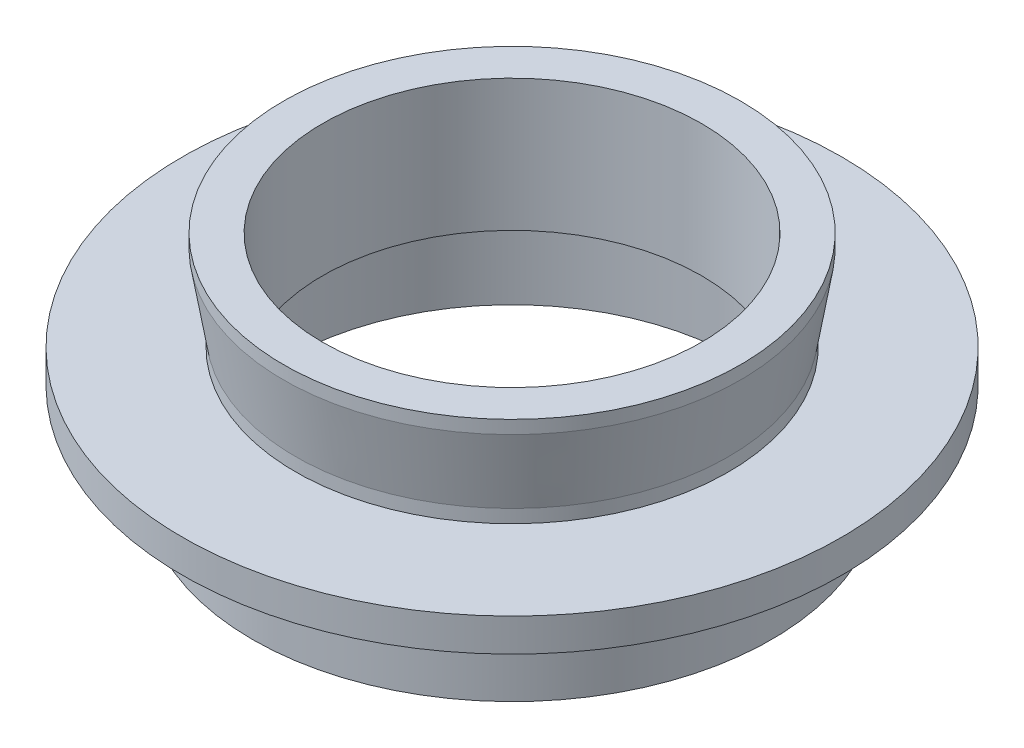
ISO-10303-21;
HEADER;
FILE_DESCRIPTION(('STEP AP214'),'2;1');
FILE_NAME('part.step','',(''),(''),'','','');
FILE_SCHEMA(('AUTOMOTIVE_DESIGN { 1 0 10303 214 1 1 1 1 }'));
ENDSEC;
DATA;
#1=APPLICATION_CONTEXT('core data for automotive mechanical design processes');
#2=APPLICATION_PROTOCOL_DEFINITION('international standard','automotive_design',2000,#1);
#3=PRODUCT_CONTEXT('',#1,'mechanical');
#4=PRODUCT('Part','Part','',(#3));
#5=PRODUCT_RELATED_PRODUCT_CATEGORY('part','',(#4));
#6=PRODUCT_DEFINITION_FORMATION('','',#4);
#7=PRODUCT_DEFINITION_CONTEXT('part definition',#1,'design');
#8=PRODUCT_DEFINITION('design','',#6,#7);
#9=PRODUCT_DEFINITION_SHAPE('','',#8);
#10=(LENGTH_UNIT() NAMED_UNIT(*) SI_UNIT(.MILLI.,.METRE.));
#11=(NAMED_UNIT(*) PLANE_ANGLE_UNIT() SI_UNIT($,.RADIAN.));
#12=(NAMED_UNIT(*) SI_UNIT($,.STERADIAN.) SOLID_ANGLE_UNIT());
#13=UNCERTAINTY_MEASURE_WITH_UNIT(LENGTH_MEASURE(1.E-05),#10,'distance_accuracy_value','');
#14=(GEOMETRIC_REPRESENTATION_CONTEXT(3) GLOBAL_UNCERTAINTY_ASSIGNED_CONTEXT((#13)) GLOBAL_UNIT_ASSIGNED_CONTEXT((#10,
#11,#12)) REPRESENTATION_CONTEXT('',''));
#15=CARTESIAN_POINT('',(0.,0.,0.));
#16=DIRECTION('',(0.,0.,1.));
#17=DIRECTION('',(1.,0.,0.));
#18=AXIS2_PLACEMENT_3D('',#15,#16,#17);
#19=CARTESIAN_POINT('',(-11.5,13.,0.));
#20=DIRECTION('',(0.,-1.,0.));
#21=DIRECTION('',(0.,0.,-1.));
#22=AXIS2_PLACEMENT_3D('',#19,#20,#21);
#23=PLANE('',#22);
#24=CARTESIAN_POINT('',(0.,13.,0.));
#25=DIRECTION('',(0.,-1.,0.));
#26=DIRECTION('',(0.,0.,-1.));
#27=AXIS2_PLACEMENT_3D('',#24,#25,#26);
#28=CIRCLE('',#27,13.865);
#29=CARTESIAN_POINT('',(0.,13.,-13.865));
#30=VERTEX_POINT('',#29);
#31=EDGE_CURVE('E10',#30,#30,#28,.T.);
#32=ORIENTED_EDGE('',*,*,#31,.F.);
#33=EDGE_LOOP('',(#32));
#34=FACE_BOUND('',#33,.T.);
#35=CARTESIAN_POINT('',(0.,13.,0.));
#36=DIRECTION('',(0.,-1.,0.));
#37=DIRECTION('',(0.,0.,-1.));
#38=AXIS2_PLACEMENT_3D('',#35,#36,#37);
#39=CIRCLE('',#38,11.5);
#40=CARTESIAN_POINT('',(0.,13.,-11.5));
#41=VERTEX_POINT('',#40);
#42=EDGE_CURVE('E83',#41,#41,#39,.T.);
#43=ORIENTED_EDGE('',*,*,#42,.T.);
#44=EDGE_LOOP('',(#43));
#45=FACE_BOUND('',#44,.T.);
#46=ADVANCED_FACE('F37',(#34,#45),#23,.F.);
#47=CARTESIAN_POINT('',(0.,0.,0.));
#48=DIRECTION('',(0.,-1.,0.));
#49=DIRECTION('',(0.,0.,-1.));
#50=AXIS2_PLACEMENT_3D('',#47,#48,#49);
#51=CYLINDRICAL_SURFACE('',#50,13.865);
#52=CARTESIAN_POINT('',(0.,12.2,0.));
#53=DIRECTION('',(0.,-1.,0.));
#54=DIRECTION('',(0.,0.,-1.));
#55=AXIS2_PLACEMENT_3D('',#52,#53,#54);
#56=CIRCLE('',#55,13.865);
#57=CARTESIAN_POINT('',(0.,12.2,-13.865));
#58=VERTEX_POINT('',#57);
#59=EDGE_CURVE('E43',#58,#58,#56,.T.);
#60=ORIENTED_EDGE('',*,*,#59,.F.);
#61=EDGE_LOOP('',(#60));
#62=FACE_BOUND('',#61,.T.);
#63=ORIENTED_EDGE('',*,*,#31,.T.);
#64=EDGE_LOOP('',(#63));
#65=FACE_BOUND('',#64,.T.);
#66=ADVANCED_FACE('F156',(#62,#65),#51,.T.);
#67=CARTESIAN_POINT('',(0.,12.2,0.));
#68=DIRECTION('',(0.,1.,0.));
#69=DIRECTION('',(0.,0.,1.));
#70=AXIS2_PLACEMENT_3D('',#67,#68,#69);
#71=CONICAL_SURFACE('',#70,13.865,0.164411486247027);
#72=CARTESIAN_POINT('',(0.,7.8,0.));
#73=DIRECTION('',(0.,-1.,0.));
#74=DIRECTION('',(0.,0.,-1.));
#75=AXIS2_PLACEMENT_3D('',#72,#73,#74);
#76=CIRCLE('',#75,13.135);
#77=CARTESIAN_POINT('',(0.,7.8,-13.135));
#78=VERTEX_POINT('',#77);
#79=EDGE_CURVE('E47',#78,#78,#76,.T.);
#80=ORIENTED_EDGE('',*,*,#79,.F.);
#81=EDGE_LOOP('',(#80));
#82=FACE_BOUND('',#81,.T.);
#83=ORIENTED_EDGE('',*,*,#59,.T.);
#84=EDGE_LOOP('',(#83));
#85=FACE_BOUND('',#84,.T.);
#86=ADVANCED_FACE('F151',(#82,#85),#71,.T.);
#87=CARTESIAN_POINT('',(0.,0.,0.));
#88=DIRECTION('',(0.,-1.,0.));
#89=DIRECTION('',(0.,0.,-1.));
#90=AXIS2_PLACEMENT_3D('',#87,#88,#89);
#91=CYLINDRICAL_SURFACE('',#90,13.135);
#92=CARTESIAN_POINT('',(0.,7.,0.));
#93=DIRECTION('',(0.,-1.,0.));
#94=DIRECTION('',(0.,0.,-1.));
#95=AXIS2_PLACEMENT_3D('',#92,#93,#94);
#96=CIRCLE('',#95,13.135);
#97=CARTESIAN_POINT('',(0.,7.,-13.135));
#98=VERTEX_POINT('',#97);
#99=EDGE_CURVE('E51',#98,#98,#96,.T.);
#100=ORIENTED_EDGE('',*,*,#99,.F.);
#101=EDGE_LOOP('',(#100));
#102=FACE_BOUND('',#101,.T.);
#103=ORIENTED_EDGE('',*,*,#79,.T.);
#104=EDGE_LOOP('',(#103));
#105=FACE_BOUND('',#104,.T.);
#106=ADVANCED_FACE('F145',(#102,#105),#91,.T.);
#107=CARTESIAN_POINT('',(-13.135,7.,0.));
#108=DIRECTION('',(0.,-1.,0.));
#109=DIRECTION('',(0.,0.,-1.));
#110=AXIS2_PLACEMENT_3D('',#107,#108,#109);
#111=PLANE('',#110);
#112=CARTESIAN_POINT('',(0.,7.,0.));
#113=DIRECTION('',(0.,-1.,0.));
#114=DIRECTION('',(0.,0.,-1.));
#115=AXIS2_PLACEMENT_3D('',#112,#113,#114);
#116=CIRCLE('',#115,20.);
#117=CARTESIAN_POINT('',(0.,7.,-20.));
#118=VERTEX_POINT('',#117);
#119=EDGE_CURVE('E56',#118,#118,#116,.T.);
#120=ORIENTED_EDGE('',*,*,#119,.F.);
#121=EDGE_LOOP('',(#120));
#122=FACE_BOUND('',#121,.T.);
#123=ORIENTED_EDGE('',*,*,#99,.T.);
#124=EDGE_LOOP('',(#123));
#125=FACE_BOUND('',#124,.T.);
#126=ADVANCED_FACE('F139',(#122,#125),#111,.F.);
#127=CARTESIAN_POINT('',(0.,0.,0.));
#128=DIRECTION('',(0.,-1.,0.));
#129=DIRECTION('',(0.,0.,-1.));
#130=AXIS2_PLACEMENT_3D('',#127,#128,#129);
#131=CYLINDRICAL_SURFACE('',#130,20.);
#132=CARTESIAN_POINT('',(0.,5.,0.));
#133=DIRECTION('',(0.,-1.,0.));
#134=DIRECTION('',(0.,0.,-1.));
#135=AXIS2_PLACEMENT_3D('',#132,#133,#134);
#136=CIRCLE('',#135,20.);
#137=CARTESIAN_POINT('',(0.,5.,-20.));
#138=VERTEX_POINT('',#137);
#139=EDGE_CURVE('E59',#138,#138,#136,.T.);
#140=ORIENTED_EDGE('',*,*,#139,.F.);
#141=EDGE_LOOP('',(#140));
#142=FACE_BOUND('',#141,.T.);
#143=ORIENTED_EDGE('',*,*,#119,.T.);
#144=EDGE_LOOP('',(#143));
#145=FACE_BOUND('',#144,.T.);
#146=ADVANCED_FACE('F133',(#142,#145),#131,.T.);
#147=CARTESIAN_POINT('',(-20.,5.,0.));
#148=DIRECTION('',(0.,1.,0.));
#149=DIRECTION('',(0.,0.,1.));
#150=AXIS2_PLACEMENT_3D('',#147,#148,#149);
#151=PLANE('',#150);
#152=CARTESIAN_POINT('',(0.,5.,0.));
#153=DIRECTION('',(0.,-1.,0.));
#154=DIRECTION('',(0.,0.,-1.));
#155=AXIS2_PLACEMENT_3D('',#152,#153,#154);
#156=CIRCLE('',#155,15.75);
#157=CARTESIAN_POINT('',(0.,5.,-15.75));
#158=VERTEX_POINT('',#157);
#159=EDGE_CURVE('E62',#158,#158,#156,.T.);
#160=ORIENTED_EDGE('',*,*,#159,.F.);
#161=EDGE_LOOP('',(#160));
#162=FACE_BOUND('',#161,.T.);
#163=ORIENTED_EDGE('',*,*,#139,.T.);
#164=EDGE_LOOP('',(#163));
#165=FACE_BOUND('',#164,.T.);
#166=ADVANCED_FACE('F127',(#162,#165),#151,.F.);
#167=CARTESIAN_POINT('',(0.,0.,0.));
#168=DIRECTION('',(0.,-1.,0.));
#169=DIRECTION('',(0.,0.,-1.));
#170=AXIS2_PLACEMENT_3D('',#167,#168,#169);
#171=CYLINDRICAL_SURFACE('',#170,15.75);
#172=CARTESIAN_POINT('',(0.,-0.500000000000002,0.));
#173=DIRECTION('',(0.,-1.,0.));
#174=DIRECTION('',(0.,0.,-1.));
#175=AXIS2_PLACEMENT_3D('',#172,#173,#174);
#176=CIRCLE('',#175,15.75);
#177=CARTESIAN_POINT('',(0.,-0.500000000000002,-15.75));
#178=VERTEX_POINT('',#177);
#179=EDGE_CURVE('E65',#178,#178,#176,.T.);
#180=ORIENTED_EDGE('',*,*,#179,.F.);
#181=EDGE_LOOP('',(#180));
#182=FACE_BOUND('',#181,.T.);
#183=ORIENTED_EDGE('',*,*,#159,.T.);
#184=EDGE_LOOP('',(#183));
#185=FACE_BOUND('',#184,.T.);
#186=ADVANCED_FACE('F121',(#182,#185),#171,.T.);
#187=CARTESIAN_POINT('',(-15.75,-0.500000000000002,0.));
#188=DIRECTION('',(0.,1.,0.));
#189=DIRECTION('',(0.,0.,1.));
#190=AXIS2_PLACEMENT_3D('',#187,#188,#189);
#191=PLANE('',#190);
#192=CARTESIAN_POINT('',(0.,-0.500000000000002,0.));
#193=DIRECTION('',(0.,-1.,0.));
#194=DIRECTION('',(0.,0.,-1.));
#195=AXIS2_PLACEMENT_3D('',#192,#193,#194);
#196=CIRCLE('',#195,13.75);
#197=CARTESIAN_POINT('',(0.,-0.500000000000002,-13.75));
#198=VERTEX_POINT('',#197);
#199=EDGE_CURVE('E68',#198,#198,#196,.T.);
#200=ORIENTED_EDGE('',*,*,#199,.F.);
#201=EDGE_LOOP('',(#200));
#202=FACE_BOUND('',#201,.T.);
#203=ORIENTED_EDGE('',*,*,#179,.T.);
#204=EDGE_LOOP('',(#203));
#205=FACE_BOUND('',#204,.T.);
#206=ADVANCED_FACE('F115',(#202,#205),#191,.F.);
#207=CARTESIAN_POINT('',(0.,0.,0.));
#208=DIRECTION('',(0.,-1.,0.));
#209=DIRECTION('',(0.,0.,-1.));
#210=AXIS2_PLACEMENT_3D('',#207,#208,#209);
#211=CYLINDRICAL_SURFACE('',#210,13.75);
#212=CARTESIAN_POINT('',(0.,4.,0.));
#213=DIRECTION('',(0.,-1.,0.));
#214=DIRECTION('',(0.,0.,-1.));
#215=AXIS2_PLACEMENT_3D('',#212,#213,#214);
#216=CIRCLE('',#215,13.75);
#217=CARTESIAN_POINT('',(0.,4.,-13.75));
#218=VERTEX_POINT('',#217);
#219=EDGE_CURVE('E71',#218,#218,#216,.T.);
#220=ORIENTED_EDGE('',*,*,#219,.F.);
#221=EDGE_LOOP('',(#220));
#222=FACE_BOUND('',#221,.T.);
#223=ORIENTED_EDGE('',*,*,#199,.T.);
#224=EDGE_LOOP('',(#223));
#225=FACE_BOUND('',#224,.T.);
#226=ADVANCED_FACE('F109',(#222,#225),#211,.F.);
#227=CARTESIAN_POINT('',(-14.5,4.,0.));
#228=DIRECTION('',(0.,-1.,0.));
#229=DIRECTION('',(0.,0.,-1.));
#230=AXIS2_PLACEMENT_3D('',#227,#228,#229);
#231=PLANE('',#230);
#232=CARTESIAN_POINT('',(0.,4.,0.));
#233=DIRECTION('',(0.,-1.,0.));
#234=DIRECTION('',(0.,0.,-1.));
#235=AXIS2_PLACEMENT_3D('',#232,#233,#234);
#236=CIRCLE('',#235,14.5);
#237=CARTESIAN_POINT('',(0.,4.,-14.5));
#238=VERTEX_POINT('',#237);
#239=EDGE_CURVE('E74',#238,#238,#236,.T.);
#240=ORIENTED_EDGE('',*,*,#239,.F.);
#241=EDGE_LOOP('',(#240));
#242=FACE_BOUND('',#241,.T.);
#243=ORIENTED_EDGE('',*,*,#219,.T.);
#244=EDGE_LOOP('',(#243));
#245=FACE_BOUND('',#244,.T.);
#246=ADVANCED_FACE('F103',(#242,#245),#231,.F.);
#247=CARTESIAN_POINT('',(0.,0.,0.));
#248=DIRECTION('',(0.,-1.,0.));
#249=DIRECTION('',(0.,0.,-1.));
#250=AXIS2_PLACEMENT_3D('',#247,#248,#249);
#251=CYLINDRICAL_SURFACE('',#250,14.5);
#252=CARTESIAN_POINT('',(0.,5.,0.));
#253=DIRECTION('',(0.,-1.,0.));
#254=DIRECTION('',(0.,0.,-1.));
#255=AXIS2_PLACEMENT_3D('',#252,#253,#254);
#256=CIRCLE('',#255,14.5);
#257=CARTESIAN_POINT('',(0.,5.,-14.5));
#258=VERTEX_POINT('',#257);
#259=EDGE_CURVE('E77',#258,#258,#256,.T.);
#260=ORIENTED_EDGE('',*,*,#259,.F.);
#261=EDGE_LOOP('',(#260));
#262=FACE_BOUND('',#261,.T.);
#263=ORIENTED_EDGE('',*,*,#239,.T.);
#264=EDGE_LOOP('',(#263));
#265=FACE_BOUND('',#264,.T.);
#266=ADVANCED_FACE('F97',(#262,#265),#251,.F.);
#267=CARTESIAN_POINT('',(-11.5,5.,0.));
#268=DIRECTION('',(0.,1.,0.));
#269=DIRECTION('',(0.,0.,1.));
#270=AXIS2_PLACEMENT_3D('',#267,#268,#269);
#271=PLANE('',#270);
#272=CARTESIAN_POINT('',(0.,5.,0.));
#273=DIRECTION('',(0.,-1.,0.));
#274=DIRECTION('',(0.,0.,-1.));
#275=AXIS2_PLACEMENT_3D('',#272,#273,#274);
#276=CIRCLE('',#275,11.5);
#277=CARTESIAN_POINT('',(0.,5.,-11.5));
#278=VERTEX_POINT('',#277);
#279=EDGE_CURVE('E80',#278,#278,#276,.T.);
#280=ORIENTED_EDGE('',*,*,#279,.F.);
#281=EDGE_LOOP('',(#280));
#282=FACE_BOUND('',#281,.T.);
#283=ORIENTED_EDGE('',*,*,#259,.T.);
#284=EDGE_LOOP('',(#283));
#285=FACE_BOUND('',#284,.T.);
#286=ADVANCED_FACE('F91',(#282,#285),#271,.F.);
#287=CARTESIAN_POINT('',(0.,0.,0.));
#288=DIRECTION('',(0.,-1.,0.));
#289=DIRECTION('',(0.,0.,-1.));
#290=AXIS2_PLACEMENT_3D('',#287,#288,#289);
#291=CYLINDRICAL_SURFACE('',#290,11.5);
#292=ORIENTED_EDGE('',*,*,#42,.F.);
#293=EDGE_LOOP('',(#292));
#294=FACE_BOUND('',#293,.T.);
#295=ORIENTED_EDGE('',*,*,#279,.T.);
#296=EDGE_LOOP('',(#295));
#297=FACE_BOUND('',#296,.T.);
#298=ADVANCED_FACE('F88',(#294,#297),#291,.F.);
#299=CLOSED_SHELL('',(#46,#66,#86,#106,#126,#146,#166,#186,#206,#226,#246,#266,#286,#298));
#300=MANIFOLD_SOLID_BREP('B2',#299);
#301=ADVANCED_BREP_SHAPE_REPRESENTATION('',(#18,#300),#14);
#302=SHAPE_DEFINITION_REPRESENTATION(#9,#301);
ENDSEC;
END-ISO-10303-21;
